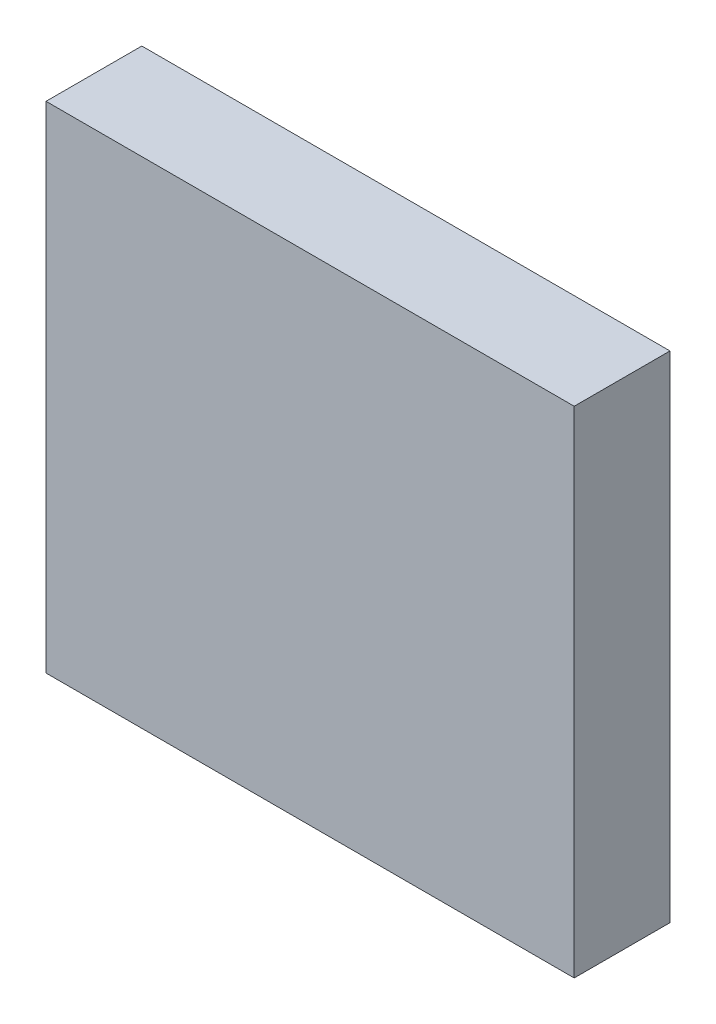
ISO-10303-21;
HEADER;
FILE_DESCRIPTION(('STEP AP214'),'2;1');
FILE_NAME('part.step','',(''),(''),'','','');
FILE_SCHEMA(('AUTOMOTIVE_DESIGN { 1 0 10303 214 1 1 1 1 }'));
ENDSEC;
DATA;
#1=APPLICATION_CONTEXT('core data for automotive mechanical design processes');
#2=APPLICATION_PROTOCOL_DEFINITION('international standard','automotive_design',2000,#1);
#3=PRODUCT_CONTEXT('',#1,'mechanical');
#4=PRODUCT('Part','Part','',(#3));
#5=PRODUCT_RELATED_PRODUCT_CATEGORY('part','',(#4));
#6=PRODUCT_DEFINITION_FORMATION('','',#4);
#7=PRODUCT_DEFINITION_CONTEXT('part definition',#1,'design');
#8=PRODUCT_DEFINITION('design','',#6,#7);
#9=PRODUCT_DEFINITION_SHAPE('','',#8);
#10=(LENGTH_UNIT() NAMED_UNIT(*) SI_UNIT(.MILLI.,.METRE.));
#11=(NAMED_UNIT(*) PLANE_ANGLE_UNIT() SI_UNIT($,.RADIAN.));
#12=(NAMED_UNIT(*) SI_UNIT($,.STERADIAN.) SOLID_ANGLE_UNIT());
#13=UNCERTAINTY_MEASURE_WITH_UNIT(LENGTH_MEASURE(1.E-05),#10,'distance_accuracy_value','');
#14=(GEOMETRIC_REPRESENTATION_CONTEXT(3) GLOBAL_UNCERTAINTY_ASSIGNED_CONTEXT((#13)) GLOBAL_UNIT_ASSIGNED_CONTEXT((#10,
#11,#12)) REPRESENTATION_CONTEXT('',''));
#15=CARTESIAN_POINT('',(0.,0.,0.));
#16=DIRECTION('',(0.,0.,1.));
#17=DIRECTION('',(1.,0.,0.));
#18=AXIS2_PLACEMENT_3D('',#15,#16,#17);
#19=CARTESIAN_POINT('',(0.,0.,17.41));
#20=DIRECTION('',(0.,1.,0.));
#21=DIRECTION('',(0.,0.,1.));
#22=AXIS2_PLACEMENT_3D('',#19,#20,#21);
#23=PLANE('',#22);
#24=DIRECTION('',(1.,0.,0.));
#25=VECTOR('',#24,1.);
#26=CARTESIAN_POINT('',(0.,0.,0.));
#27=LINE('',#26,#25);
#28=CARTESIAN_POINT('',(-96.,0.,0.));
#29=VERTEX_POINT('',#28);
#30=CARTESIAN_POINT('',(0.,0.,0.));
#31=VERTEX_POINT('',#30);
#32=EDGE_CURVE('E107',#29,#31,#27,.T.);
#33=ORIENTED_EDGE('',*,*,#32,.T.);
#34=DIRECTION('',(0.,0.,-1.));
#35=VECTOR('',#34,1.);
#36=CARTESIAN_POINT('',(0.,0.,17.41));
#37=LINE('',#36,#35);
#38=CARTESIAN_POINT('',(0.,0.,17.41));
#39=VERTEX_POINT('',#38);
#40=EDGE_CURVE('E11',#39,#31,#37,.T.);
#41=ORIENTED_EDGE('',*,*,#40,.F.);
#42=DIRECTION('',(1.,0.,0.));
#43=VECTOR('',#42,1.);
#44=CARTESIAN_POINT('',(0.,0.,17.41));
#45=LINE('',#44,#43);
#46=CARTESIAN_POINT('',(-96.,0.,17.41));
#47=VERTEX_POINT('',#46);
#48=EDGE_CURVE('E95',#47,#39,#45,.T.);
#49=ORIENTED_EDGE('',*,*,#48,.F.);
#50=DIRECTION('',(0.,0.,-1.));
#51=VECTOR('',#50,1.);
#52=CARTESIAN_POINT('',(-96.,0.,17.41));
#53=LINE('',#52,#51);
#54=EDGE_CURVE('E103',#47,#29,#53,.T.);
#55=ORIENTED_EDGE('',*,*,#54,.T.);
#56=EDGE_LOOP('',(#33,#41,#49,#55));
#57=FACE_BOUND('',#56,.T.);
#58=ADVANCED_FACE('F44',(#57),#23,.F.);
#59=CARTESIAN_POINT('',(0.,0.,17.41));
#60=DIRECTION('',(-1.,0.,0.));
#61=DIRECTION('',(0.,0.,1.));
#62=AXIS2_PLACEMENT_3D('',#59,#60,#61);
#63=PLANE('',#62);
#64=DIRECTION('',(0.,1.,0.));
#65=VECTOR('',#64,1.);
#66=CARTESIAN_POINT('',(0.,0.,0.));
#67=LINE('',#66,#65);
#68=CARTESIAN_POINT('',(0.,90.,0.));
#69=VERTEX_POINT('',#68);
#70=EDGE_CURVE('E99',#31,#69,#67,.T.);
#71=ORIENTED_EDGE('',*,*,#70,.T.);
#72=DIRECTION('',(0.,0.,-1.));
#73=VECTOR('',#72,1.);
#74=CARTESIAN_POINT('',(0.,90.,17.41));
#75=LINE('',#74,#73);
#76=CARTESIAN_POINT('',(0.,90.,17.41));
#77=VERTEX_POINT('',#76);
#78=EDGE_CURVE('E52',#77,#69,#75,.T.);
#79=ORIENTED_EDGE('',*,*,#78,.F.);
#80=DIRECTION('',(0.,1.,0.));
#81=VECTOR('',#80,1.);
#82=CARTESIAN_POINT('',(0.,0.,17.41));
#83=LINE('',#82,#81);
#84=EDGE_CURVE('E90',#39,#77,#83,.T.);
#85=ORIENTED_EDGE('',*,*,#84,.F.);
#86=ORIENTED_EDGE('',*,*,#40,.T.);
#87=EDGE_LOOP('',(#71,#79,#85,#86));
#88=FACE_BOUND('',#87,.T.);
#89=ADVANCED_FACE('F98',(#88),#63,.F.);
#90=CARTESIAN_POINT('',(0.,90.,17.41));
#91=DIRECTION('',(0.,-1.,0.));
#92=DIRECTION('',(0.,0.,-1.));
#93=AXIS2_PLACEMENT_3D('',#90,#91,#92);
#94=PLANE('',#93);
#95=DIRECTION('',(-1.,0.,0.));
#96=VECTOR('',#95,1.);
#97=CARTESIAN_POINT('',(0.,90.,0.));
#98=LINE('',#97,#96);
#99=CARTESIAN_POINT('',(-96.,90.,0.));
#100=VERTEX_POINT('',#99);
#101=EDGE_CURVE('E77',#69,#100,#98,.T.);
#102=ORIENTED_EDGE('',*,*,#101,.T.);
#103=DIRECTION('',(0.,0.,-1.));
#104=VECTOR('',#103,1.);
#105=CARTESIAN_POINT('',(-96.,90.,17.41));
#106=LINE('',#105,#104);
#107=CARTESIAN_POINT('',(-96.,90.,17.41));
#108=VERTEX_POINT('',#107);
#109=EDGE_CURVE('E100',#108,#100,#106,.T.);
#110=ORIENTED_EDGE('',*,*,#109,.F.);
#111=DIRECTION('',(-1.,0.,0.));
#112=VECTOR('',#111,1.);
#113=CARTESIAN_POINT('',(0.,90.,17.41));
#114=LINE('',#113,#112);
#115=EDGE_CURVE('E93',#77,#108,#114,.T.);
#116=ORIENTED_EDGE('',*,*,#115,.F.);
#117=ORIENTED_EDGE('',*,*,#78,.T.);
#118=EDGE_LOOP('',(#102,#110,#116,#117));
#119=FACE_BOUND('',#118,.T.);
#120=ADVANCED_FACE('F101',(#119),#94,.F.);
#121=CARTESIAN_POINT('',(-96.,0.,17.41));
#122=DIRECTION('',(1.,0.,0.));
#123=DIRECTION('',(0.,0.,-1.));
#124=AXIS2_PLACEMENT_3D('',#121,#122,#123);
#125=PLANE('',#124);
#126=DIRECTION('',(0.,-1.,0.));
#127=VECTOR('',#126,1.);
#128=CARTESIAN_POINT('',(-96.,0.,0.));
#129=LINE('',#128,#127);
#130=EDGE_CURVE('E83',#100,#29,#129,.T.);
#131=ORIENTED_EDGE('',*,*,#130,.T.);
#132=ORIENTED_EDGE('',*,*,#54,.F.);
#133=DIRECTION('',(0.,-1.,0.));
#134=VECTOR('',#133,1.);
#135=CARTESIAN_POINT('',(-96.,0.,17.41));
#136=LINE('',#135,#134);
#137=EDGE_CURVE('E60',#108,#47,#136,.T.);
#138=ORIENTED_EDGE('',*,*,#137,.F.);
#139=ORIENTED_EDGE('',*,*,#109,.T.);
#140=EDGE_LOOP('',(#131,#132,#138,#139));
#141=FACE_BOUND('',#140,.T.);
#142=ADVANCED_FACE('F114',(#141),#125,.F.);
#143=CARTESIAN_POINT('',(0.,0.,17.41));
#144=DIRECTION('',(0.,0.,-1.));
#145=DIRECTION('',(-1.,0.,0.));
#146=AXIS2_PLACEMENT_3D('',#143,#144,#145);
#147=PLANE('',#146);
#148=ORIENTED_EDGE('',*,*,#48,.T.);
#149=ORIENTED_EDGE('',*,*,#84,.T.);
#150=ORIENTED_EDGE('',*,*,#115,.T.);
#151=ORIENTED_EDGE('',*,*,#137,.T.);
#152=EDGE_LOOP('',(#148,#149,#150,#151));
#153=FACE_BOUND('',#152,.T.);
#154=ADVANCED_FACE('F91',(#153),#147,.F.);
#155=CARTESIAN_POINT('',(0.,0.,0.));
#156=DIRECTION('',(0.,0.,-1.));
#157=DIRECTION('',(-1.,0.,0.));
#158=AXIS2_PLACEMENT_3D('',#155,#156,#157);
#159=PLANE('',#158);
#160=ORIENTED_EDGE('',*,*,#32,.F.);
#161=ORIENTED_EDGE('',*,*,#130,.F.);
#162=ORIENTED_EDGE('',*,*,#101,.F.);
#163=ORIENTED_EDGE('',*,*,#70,.F.);
#164=EDGE_LOOP('',(#160,#161,#162,#163));
#165=FACE_BOUND('',#164,.T.);
#166=ADVANCED_FACE('F117',(#165),#159,.T.);
#167=CLOSED_SHELL('',(#58,#89,#120,#142,#154,#166));
#168=MANIFOLD_SOLID_BREP('B2',#167);
#169=ADVANCED_BREP_SHAPE_REPRESENTATION('',(#18,#168),#14);
#170=SHAPE_DEFINITION_REPRESENTATION(#9,#169);
ENDSEC;
END-ISO-10303-21;
